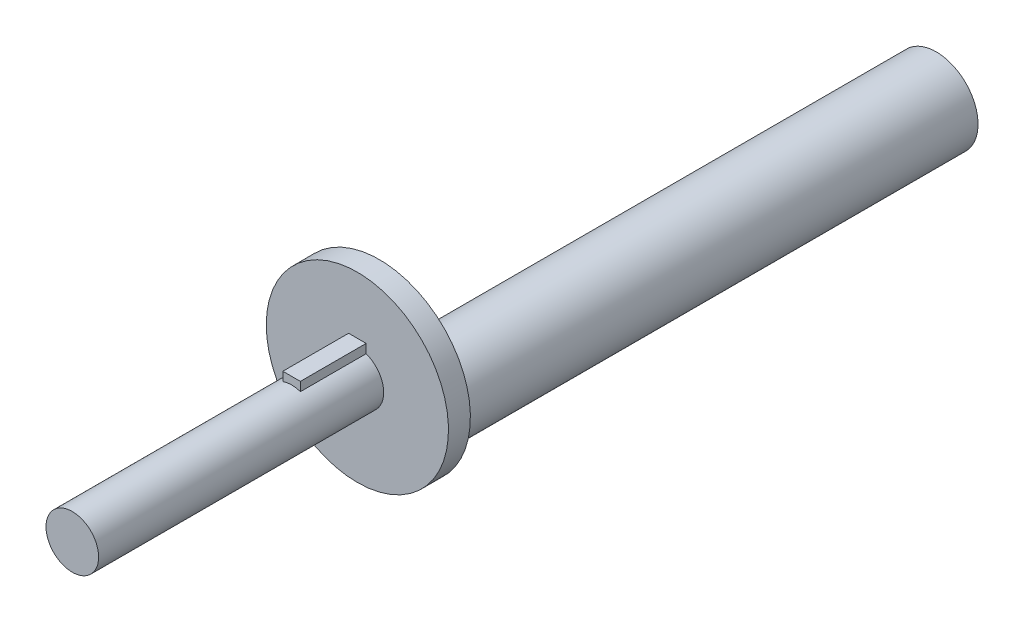
ISO-10303-21;
HEADER;
FILE_DESCRIPTION(('STEP AP214'),'2;1');
FILE_NAME('part.step','',(''),(''),'','','');
FILE_SCHEMA(('AUTOMOTIVE_DESIGN { 1 0 10303 214 1 1 1 1 }'));
ENDSEC;
DATA;
#1=APPLICATION_CONTEXT('core data for automotive mechanical design processes');
#2=APPLICATION_PROTOCOL_DEFINITION('international standard','automotive_design',2000,#1);
#3=PRODUCT_CONTEXT('',#1,'mechanical');
#4=PRODUCT('Part','Part','',(#3));
#5=PRODUCT_RELATED_PRODUCT_CATEGORY('part','',(#4));
#6=PRODUCT_DEFINITION_FORMATION('','',#4);
#7=PRODUCT_DEFINITION_CONTEXT('part definition',#1,'design');
#8=PRODUCT_DEFINITION('design','',#6,#7);
#9=PRODUCT_DEFINITION_SHAPE('','',#8);
#10=(LENGTH_UNIT() NAMED_UNIT(*) SI_UNIT(.MILLI.,.METRE.));
#11=(NAMED_UNIT(*) PLANE_ANGLE_UNIT() SI_UNIT($,.RADIAN.));
#12=(NAMED_UNIT(*) SI_UNIT($,.STERADIAN.) SOLID_ANGLE_UNIT());
#13=UNCERTAINTY_MEASURE_WITH_UNIT(LENGTH_MEASURE(1.E-05),#10,'distance_accuracy_value','');
#14=(GEOMETRIC_REPRESENTATION_CONTEXT(3) GLOBAL_UNCERTAINTY_ASSIGNED_CONTEXT((#13)) GLOBAL_UNIT_ASSIGNED_CONTEXT((#10,
#11,#12)) REPRESENTATION_CONTEXT('',''));
#15=CARTESIAN_POINT('',(0.,0.,0.));
#16=DIRECTION('',(0.,0.,1.));
#17=DIRECTION('',(1.,0.,0.));
#18=AXIS2_PLACEMENT_3D('',#15,#16,#17);
#19=CARTESIAN_POINT('',(2.,7.7,15.));
#20=DIRECTION('',(-1.,0.,0.));
#21=DIRECTION('',(0.,0.,1.));
#22=AXIS2_PLACEMENT_3D('',#19,#20,#21);
#23=PLANE('',#22);
#24=DIRECTION('',(0.,1.,0.));
#25=VECTOR('',#24,1.);
#26=CARTESIAN_POINT('',(2.,7.7,0.));
#27=LINE('',#26,#25);
#28=CARTESIAN_POINT('',(2.,5.65685424949238,0.));
#29=VERTEX_POINT('',#28);
#30=CARTESIAN_POINT('',(2.,7.7,0.));
#31=VERTEX_POINT('',#30);
#32=EDGE_CURVE('E106',#29,#31,#27,.T.);
#33=ORIENTED_EDGE('',*,*,#32,.T.);
#34=DIRECTION('',(0.,0.,-1.));
#35=VECTOR('',#34,1.);
#36=CARTESIAN_POINT('',(2.,7.7,15.));
#37=LINE('',#36,#35);
#38=CARTESIAN_POINT('',(2.,7.7,15.));
#39=VERTEX_POINT('',#38);
#40=EDGE_CURVE('E11',#39,#31,#37,.T.);
#41=ORIENTED_EDGE('',*,*,#40,.F.);
#42=DIRECTION('',(0.,1.,0.));
#43=VECTOR('',#42,1.);
#44=CARTESIAN_POINT('',(2.,7.7,15.));
#45=LINE('',#44,#43);
#46=CARTESIAN_POINT('',(2.,5.65685424949238,15.));
#47=VERTEX_POINT('',#46);
#48=EDGE_CURVE('E74',#47,#39,#45,.T.);
#49=ORIENTED_EDGE('',*,*,#48,.F.);
#50=DIRECTION('',(0.,0.,-1.));
#51=VECTOR('',#50,1.);
#52=CARTESIAN_POINT('',(2.,5.65685424949238,15.));
#53=LINE('',#52,#51);
#54=EDGE_CURVE('E77',#47,#29,#53,.T.);
#55=ORIENTED_EDGE('',*,*,#54,.T.);
#56=EDGE_LOOP('',(#33,#41,#49,#55));
#57=FACE_BOUND('',#56,.T.);
#58=ADVANCED_FACE('F34',(#57),#23,.F.);
#59=CARTESIAN_POINT('',(-2.,7.7,15.));
#60=DIRECTION('',(0.,-1.,0.));
#61=DIRECTION('',(1.,0.,0.));
#62=AXIS2_PLACEMENT_3D('',#59,#60,#61);
#63=PLANE('',#62);
#64=DIRECTION('',(-1.,0.,0.));
#65=VECTOR('',#64,1.);
#66=CARTESIAN_POINT('',(-2.,7.7,0.));
#67=LINE('',#66,#65);
#68=CARTESIAN_POINT('',(-2.,7.7,0.));
#69=VERTEX_POINT('',#68);
#70=EDGE_CURVE('E112',#31,#69,#67,.T.);
#71=ORIENTED_EDGE('',*,*,#70,.T.);
#72=DIRECTION('',(0.,0.,-1.));
#73=VECTOR('',#72,1.);
#74=CARTESIAN_POINT('',(-2.,7.7,15.));
#75=LINE('',#74,#73);
#76=CARTESIAN_POINT('',(-2.,7.7,15.));
#77=VERTEX_POINT('',#76);
#78=EDGE_CURVE('E42',#77,#69,#75,.T.);
#79=ORIENTED_EDGE('',*,*,#78,.F.);
#80=DIRECTION('',(-1.,0.,0.));
#81=VECTOR('',#80,1.);
#82=CARTESIAN_POINT('',(-2.,7.7,15.));
#83=LINE('',#82,#81);
#84=EDGE_CURVE('E78',#39,#77,#83,.T.);
#85=ORIENTED_EDGE('',*,*,#84,.F.);
#86=ORIENTED_EDGE('',*,*,#40,.T.);
#87=EDGE_LOOP('',(#71,#79,#85,#86));
#88=FACE_BOUND('',#87,.T.);
#89=ADVANCED_FACE('F125',(#88),#63,.F.);
#90=CARTESIAN_POINT('',(-2.,5.65685424949238,15.));
#91=DIRECTION('',(1.,0.,0.));
#92=DIRECTION('',(0.,0.,-1.));
#93=AXIS2_PLACEMENT_3D('',#90,#91,#92);
#94=PLANE('',#93);
#95=DIRECTION('',(0.,-1.,0.));
#96=VECTOR('',#95,1.);
#97=CARTESIAN_POINT('',(-2.,5.65685424949238,0.));
#98=LINE('',#97,#96);
#99=CARTESIAN_POINT('',(-2.,5.65685424949238,0.));
#100=VERTEX_POINT('',#99);
#101=EDGE_CURVE('E115',#69,#100,#98,.T.);
#102=ORIENTED_EDGE('',*,*,#101,.T.);
#103=DIRECTION('',(0.,0.,-1.));
#104=VECTOR('',#103,1.);
#105=CARTESIAN_POINT('',(-2.,5.65685424949238,15.));
#106=LINE('',#105,#104);
#107=CARTESIAN_POINT('',(-2.,5.65685424949238,15.));
#108=VERTEX_POINT('',#107);
#109=EDGE_CURVE('E88',#108,#100,#106,.T.);
#110=ORIENTED_EDGE('',*,*,#109,.F.);
#111=DIRECTION('',(0.,-1.,0.));
#112=VECTOR('',#111,1.);
#113=CARTESIAN_POINT('',(-2.,5.65685424949238,15.));
#114=LINE('',#113,#112);
#115=EDGE_CURVE('E49',#77,#108,#114,.T.);
#116=ORIENTED_EDGE('',*,*,#115,.F.);
#117=ORIENTED_EDGE('',*,*,#78,.T.);
#118=EDGE_LOOP('',(#102,#110,#116,#117));
#119=FACE_BOUND('',#118,.T.);
#120=ADVANCED_FACE('F122',(#119),#94,.F.);
#121=CARTESIAN_POINT('',(0.,0.,15.));
#122=DIRECTION('',(0.,0.,-1.));
#123=DIRECTION('',(-1.,0.,0.));
#124=AXIS2_PLACEMENT_3D('',#121,#122,#123);
#125=CYLINDRICAL_SURFACE('',#124,6.);
#126=CARTESIAN_POINT('',(0.,0.,0.));
#127=DIRECTION('',(0.,0.,1.));
#128=DIRECTION('',(1.,0.,0.));
#129=AXIS2_PLACEMENT_3D('',#126,#127,#128);
#130=CIRCLE('',#129,6.);
#131=EDGE_CURVE('E79',#100,#29,#130,.T.);
#132=ORIENTED_EDGE('',*,*,#131,.T.);
#133=ORIENTED_EDGE('',*,*,#54,.F.);
#134=CARTESIAN_POINT('',(0.,0.,15.));
#135=DIRECTION('',(0.,0.,1.));
#136=DIRECTION('',(1.,0.,0.));
#137=AXIS2_PLACEMENT_3D('',#134,#135,#136);
#138=CIRCLE('',#137,6.);
#139=EDGE_CURVE('E87',#47,#108,#138,.T.);
#140=ORIENTED_EDGE('',*,*,#139,.T.);
#141=ORIENTED_EDGE('',*,*,#109,.T.);
#142=EDGE_LOOP('',(#132,#133,#140,#141));
#143=FACE_BOUND('',#142,.T.);
#144=CARTESIAN_POINT('',(0.,0.,65.));
#145=DIRECTION('',(0.,0.,1.));
#146=DIRECTION('',(1.,0.,0.));
#147=AXIS2_PLACEMENT_3D('',#144,#145,#146);
#148=CIRCLE('',#147,6.);
#149=CARTESIAN_POINT('',(6.,0.,65.));
#150=VERTEX_POINT('',#149);
#151=EDGE_CURVE('E91',#150,#150,#148,.T.);
#152=ORIENTED_EDGE('',*,*,#151,.F.);
#153=EDGE_LOOP('',(#152));
#154=FACE_BOUND('',#153,.T.);
#155=ADVANCED_FACE('F84',(#143,#154),#125,.T.);
#156=CARTESIAN_POINT('',(0.,0.,15.));
#157=DIRECTION('',(0.,0.,1.));
#158=DIRECTION('',(1.,0.,0.));
#159=AXIS2_PLACEMENT_3D('',#156,#157,#158);
#160=PLANE('',#159);
#161=ORIENTED_EDGE('',*,*,#139,.F.);
#162=ORIENTED_EDGE('',*,*,#48,.T.);
#163=ORIENTED_EDGE('',*,*,#84,.T.);
#164=ORIENTED_EDGE('',*,*,#115,.T.);
#165=EDGE_LOOP('',(#161,#162,#163,#164));
#166=FACE_BOUND('',#165,.T.);
#167=ADVANCED_FACE('F90',(#166),#160,.T.);
#168=CARTESIAN_POINT('',(0.,0.,-5.));
#169=DIRECTION('',(0.,0.,1.));
#170=DIRECTION('',(1.,0.,0.));
#171=AXIS2_PLACEMENT_3D('',#168,#169,#170);
#172=CYLINDRICAL_SURFACE('',#171,20.775);
#173=CARTESIAN_POINT('',(0.,0.,-5.));
#174=DIRECTION('',(0.,0.,-1.));
#175=DIRECTION('',(-1.,0.,0.));
#176=AXIS2_PLACEMENT_3D('',#173,#174,#175);
#177=CIRCLE('',#176,20.775);
#178=CARTESIAN_POINT('',(0.,-20.775,-5.));
#179=VERTEX_POINT('',#178);
#180=EDGE_CURVE('E103',#179,#179,#177,.T.);
#181=ORIENTED_EDGE('',*,*,#180,.F.);
#182=EDGE_LOOP('',(#181));
#183=FACE_BOUND('',#182,.T.);
#184=CARTESIAN_POINT('',(0.,0.,0.));
#185=DIRECTION('',(0.,0.,-1.));
#186=DIRECTION('',(-1.,0.,0.));
#187=AXIS2_PLACEMENT_3D('',#184,#185,#186);
#188=CIRCLE('',#187,20.775);
#189=CARTESIAN_POINT('',(-20.775,0.,0.));
#190=VERTEX_POINT('',#189);
#191=EDGE_CURVE('E100',#190,#190,#188,.T.);
#192=ORIENTED_EDGE('',*,*,#191,.T.);
#193=EDGE_LOOP('',(#192));
#194=FACE_BOUND('',#193,.T.);
#195=ADVANCED_FACE('F135',(#183,#194),#172,.T.);
#196=CARTESIAN_POINT('',(0.,0.,-5.));
#197=DIRECTION('',(0.,0.,-1.));
#198=DIRECTION('',(-1.,0.,0.));
#199=AXIS2_PLACEMENT_3D('',#196,#197,#198);
#200=PLANE('',#199);
#201=ORIENTED_EDGE('',*,*,#180,.T.);
#202=CARTESIAN_POINT('',(0.,-11.25,-5.));
#203=DIRECTION('',(0.,0.,-1.));
#204=DIRECTION('',(-1.,0.,0.));
#205=AXIS2_PLACEMENT_3D('',#202,#203,#204);
#206=CIRCLE('',#205,9.525);
#207=EDGE_CURVE('E94',#179,#179,#206,.T.);
#208=ORIENTED_EDGE('',*,*,#207,.F.);
#209=EDGE_LOOP('',(#201,#208));
#210=FACE_BOUND('',#209,.T.);
#211=ADVANCED_FACE('F131',(#210),#200,.T.);
#212=CARTESIAN_POINT('',(0.,0.,0.));
#213=DIRECTION('',(0.,0.,-1.));
#214=DIRECTION('',(-1.,0.,0.));
#215=AXIS2_PLACEMENT_3D('',#212,#213,#214);
#216=PLANE('',#215);
#217=ORIENTED_EDGE('',*,*,#32,.F.);
#218=ORIENTED_EDGE('',*,*,#131,.F.);
#219=ORIENTED_EDGE('',*,*,#101,.F.);
#220=ORIENTED_EDGE('',*,*,#70,.F.);
#221=EDGE_LOOP('',(#217,#218,#219,#220));
#222=FACE_BOUND('',#221,.T.);
#223=ORIENTED_EDGE('',*,*,#191,.F.);
#224=EDGE_LOOP('',(#223));
#225=FACE_BOUND('',#224,.T.);
#226=ADVANCED_FACE('F127',(#222,#225),#216,.F.);
#227=CARTESIAN_POINT('',(0.,-11.25,-132.));
#228=DIRECTION('',(0.,0.,1.));
#229=DIRECTION('',(1.,0.,0.));
#230=AXIS2_PLACEMENT_3D('',#227,#228,#229);
#231=CYLINDRICAL_SURFACE('',#230,9.525);
#232=CARTESIAN_POINT('',(0.,-11.25,-132.));
#233=DIRECTION('',(0.,0.,-1.));
#234=DIRECTION('',(-1.,0.,0.));
#235=AXIS2_PLACEMENT_3D('',#232,#233,#234);
#236=CIRCLE('',#235,9.525);
#237=CARTESIAN_POINT('',(-9.525,-11.25,-132.));
#238=VERTEX_POINT('',#237);
#239=EDGE_CURVE('E97',#238,#238,#236,.T.);
#240=ORIENTED_EDGE('',*,*,#239,.F.);
#241=EDGE_LOOP('',(#240));
#242=FACE_BOUND('',#241,.T.);
#243=ORIENTED_EDGE('',*,*,#207,.T.);
#244=EDGE_LOOP('',(#243));
#245=FACE_BOUND('',#244,.T.);
#246=ADVANCED_FACE('F130',(#242,#245),#231,.T.);
#247=CARTESIAN_POINT('',(0.,-11.25,-132.));
#248=DIRECTION('',(0.,0.,-1.));
#249=DIRECTION('',(-1.,0.,0.));
#250=AXIS2_PLACEMENT_3D('',#247,#248,#249);
#251=PLANE('',#250);
#252=ORIENTED_EDGE('',*,*,#239,.T.);
#253=EDGE_LOOP('',(#252));
#254=FACE_BOUND('',#253,.T.);
#255=ADVANCED_FACE('F175',(#254),#251,.T.);
#256=CARTESIAN_POINT('',(0.,0.,65.));
#257=DIRECTION('',(0.,0.,1.));
#258=DIRECTION('',(1.,0.,0.));
#259=AXIS2_PLACEMENT_3D('',#256,#257,#258);
#260=PLANE('',#259);
#261=ORIENTED_EDGE('',*,*,#151,.T.);
#262=EDGE_LOOP('',(#261));
#263=FACE_BOUND('',#262,.T.);
#264=ADVANCED_FACE('F171',(#263),#260,.T.);
#265=CLOSED_SHELL('',(#58,#89,#120,#155,#167,#195,#211,#226,#246,#255,#264));
#266=MANIFOLD_SOLID_BREP('B2',#265);
#267=ADVANCED_BREP_SHAPE_REPRESENTATION('',(#18,#266),#14);
#268=SHAPE_DEFINITION_REPRESENTATION(#9,#267);
ENDSEC;
END-ISO-10303-21;
